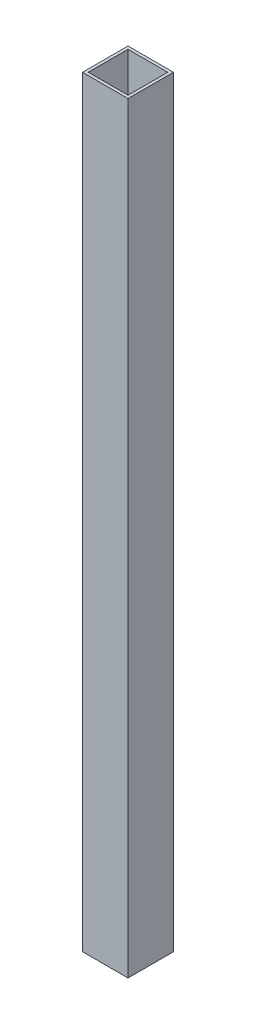
ISO-10303-21;
HEADER;
FILE_DESCRIPTION(('STEP AP214'),'2;1');
FILE_NAME('part.step','',(''),(''),'','','');
FILE_SCHEMA(('AUTOMOTIVE_DESIGN { 1 0 10303 214 1 1 1 1 }'));
ENDSEC;
DATA;
#1=APPLICATION_CONTEXT('core data for automotive mechanical design processes');
#2=APPLICATION_PROTOCOL_DEFINITION('international standard','automotive_design',2000,#1);
#3=PRODUCT_CONTEXT('',#1,'mechanical');
#4=PRODUCT('Part','Part','',(#3));
#5=PRODUCT_RELATED_PRODUCT_CATEGORY('part','',(#4));
#6=PRODUCT_DEFINITION_FORMATION('','',#4);
#7=PRODUCT_DEFINITION_CONTEXT('part definition',#1,'design');
#8=PRODUCT_DEFINITION('design','',#6,#7);
#9=PRODUCT_DEFINITION_SHAPE('','',#8);
#10=(LENGTH_UNIT() NAMED_UNIT(*) SI_UNIT(.MILLI.,.METRE.));
#11=(NAMED_UNIT(*) PLANE_ANGLE_UNIT() SI_UNIT($,.RADIAN.));
#12=(NAMED_UNIT(*) SI_UNIT($,.STERADIAN.) SOLID_ANGLE_UNIT());
#13=UNCERTAINTY_MEASURE_WITH_UNIT(LENGTH_MEASURE(1.E-05),#10,'distance_accuracy_value','');
#14=(GEOMETRIC_REPRESENTATION_CONTEXT(3) GLOBAL_UNCERTAINTY_ASSIGNED_CONTEXT((#13)) GLOBAL_UNIT_ASSIGNED_CONTEXT((#10,
#11,#12)) REPRESENTATION_CONTEXT('',''));
#15=CARTESIAN_POINT('',(0.,0.,0.));
#16=DIRECTION('',(0.,0.,1.));
#17=DIRECTION('',(1.,0.,0.));
#18=AXIS2_PLACEMENT_3D('',#15,#16,#17);
#19=CARTESIAN_POINT('',(25.4000000000001,922.742248335404,-25.4));
#20=DIRECTION('',(0.,0.,1.));
#21=DIRECTION('',(1.,0.,0.));
#22=AXIS2_PLACEMENT_3D('',#19,#20,#21);
#23=PLANE('',#22);
#24=DIRECTION('',(-1.,0.,0.));
#25=VECTOR('',#24,1.);
#26=CARTESIAN_POINT('',(25.4000000000001,850.900199366851,-25.4));
#27=LINE('',#26,#25);
#28=CARTESIAN_POINT('',(25.4000000000001,850.900199366851,-25.4));
#29=VERTEX_POINT('',#28);
#30=CARTESIAN_POINT('',(-25.3999999999999,850.900199366851,-25.4));
#31=VERTEX_POINT('',#30);
#32=EDGE_CURVE('E11',#29,#31,#27,.T.);
#33=ORIENTED_EDGE('',*,*,#32,.F.);
#34=DIRECTION('',(0.,-1.,0.));
#35=VECTOR('',#34,1.);
#36=CARTESIAN_POINT('',(25.4000000000001,922.742248335404,-25.4));
#37=LINE('',#36,#35);
#38=CARTESIAN_POINT('',(25.4000000000001,0.,-25.4));
#39=VERTEX_POINT('',#38);
#40=EDGE_CURVE('E141',#29,#39,#37,.T.);
#41=ORIENTED_EDGE('',*,*,#40,.T.);
#42=DIRECTION('',(-1.,0.,0.));
#43=VECTOR('',#42,1.);
#44=CARTESIAN_POINT('',(25.4000000000001,0.,-25.4));
#45=LINE('',#44,#43);
#46=CARTESIAN_POINT('',(-25.4000000000001,0.,-25.4));
#47=VERTEX_POINT('',#46);
#48=EDGE_CURVE('E136',#39,#47,#45,.T.);
#49=ORIENTED_EDGE('',*,*,#48,.T.);
#50=DIRECTION('',(0.,-1.,0.));
#51=VECTOR('',#50,1.);
#52=CARTESIAN_POINT('',(-25.3999999999999,922.742248335404,-25.4));
#53=LINE('',#52,#51);
#54=EDGE_CURVE('E139',#31,#47,#53,.T.);
#55=ORIENTED_EDGE('',*,*,#54,.F.);
#56=EDGE_LOOP('',(#33,#41,#49,#55));
#57=FACE_BOUND('',#56,.T.);
#58=ADVANCED_FACE('F29',(#57),#23,.F.);
#59=CARTESIAN_POINT('',(25.4000000000001,922.742248335404,25.4));
#60=DIRECTION('',(-1.,0.,0.));
#61=DIRECTION('',(0.,0.,1.));
#62=AXIS2_PLACEMENT_3D('',#59,#60,#61);
#63=PLANE('',#62);
#64=DIRECTION('',(0.,0.,-1.));
#65=VECTOR('',#64,1.);
#66=CARTESIAN_POINT('',(25.4000000000001,850.900199366851,25.4));
#67=LINE('',#66,#65);
#68=CARTESIAN_POINT('',(25.4000000000001,850.900199366851,25.4));
#69=VERTEX_POINT('',#68);
#70=EDGE_CURVE('E149',#69,#29,#67,.T.);
#71=ORIENTED_EDGE('',*,*,#70,.F.);
#72=DIRECTION('',(0.,-1.,0.));
#73=VECTOR('',#72,1.);
#74=CARTESIAN_POINT('',(25.4000000000001,922.742248335404,25.4));
#75=LINE('',#74,#73);
#76=CARTESIAN_POINT('',(25.4000000000001,0.,25.4));
#77=VERTEX_POINT('',#76);
#78=EDGE_CURVE('E143',#69,#77,#75,.T.);
#79=ORIENTED_EDGE('',*,*,#78,.T.);
#80=DIRECTION('',(0.,0.,-1.));
#81=VECTOR('',#80,1.);
#82=CARTESIAN_POINT('',(25.4000000000001,0.,25.4));
#83=LINE('',#82,#81);
#84=EDGE_CURVE('E133',#77,#39,#83,.T.);
#85=ORIENTED_EDGE('',*,*,#84,.T.);
#86=ORIENTED_EDGE('',*,*,#40,.F.);
#87=EDGE_LOOP('',(#71,#79,#85,#86));
#88=FACE_BOUND('',#87,.T.);
#89=ADVANCED_FACE('F173',(#88),#63,.F.);
#90=CARTESIAN_POINT('',(25.4000000000001,922.742248335404,25.4));
#91=DIRECTION('',(0.,0.,-1.));
#92=DIRECTION('',(-1.,0.,0.));
#93=AXIS2_PLACEMENT_3D('',#90,#91,#92);
#94=PLANE('',#93);
#95=DIRECTION('',(1.,0.,0.));
#96=VECTOR('',#95,1.);
#97=CARTESIAN_POINT('',(25.4000000000001,850.900199366851,25.4));
#98=LINE('',#97,#96);
#99=CARTESIAN_POINT('',(-25.3999999999999,850.900199366851,25.4));
#100=VERTEX_POINT('',#99);
#101=EDGE_CURVE('E33',#100,#69,#98,.T.);
#102=ORIENTED_EDGE('',*,*,#101,.F.);
#103=DIRECTION('',(0.,-1.,0.));
#104=VECTOR('',#103,1.);
#105=CARTESIAN_POINT('',(-25.3999999999999,922.742248335404,25.4));
#106=LINE('',#105,#104);
#107=CARTESIAN_POINT('',(-25.4000000000001,0.,25.4));
#108=VERTEX_POINT('',#107);
#109=EDGE_CURVE('E145',#100,#108,#106,.T.);
#110=ORIENTED_EDGE('',*,*,#109,.T.);
#111=DIRECTION('',(1.,0.,0.));
#112=VECTOR('',#111,1.);
#113=CARTESIAN_POINT('',(25.4000000000001,0.,25.4));
#114=LINE('',#113,#112);
#115=EDGE_CURVE('E130',#108,#77,#114,.T.);
#116=ORIENTED_EDGE('',*,*,#115,.T.);
#117=ORIENTED_EDGE('',*,*,#78,.F.);
#118=EDGE_LOOP('',(#102,#110,#116,#117));
#119=FACE_BOUND('',#118,.T.);
#120=ADVANCED_FACE('F179',(#119),#94,.F.);
#121=CARTESIAN_POINT('',(-25.3999999999999,922.742248335404,25.4));
#122=DIRECTION('',(1.,0.,0.));
#123=DIRECTION('',(0.,0.,-1.));
#124=AXIS2_PLACEMENT_3D('',#121,#122,#123);
#125=PLANE('',#124);
#126=DIRECTION('',(0.,0.,1.));
#127=VECTOR('',#126,1.);
#128=CARTESIAN_POINT('',(-25.3999999999999,850.900199366851,25.4));
#129=LINE('',#128,#127);
#130=EDGE_CURVE('E44',#31,#100,#129,.T.);
#131=ORIENTED_EDGE('',*,*,#130,.F.);
#132=ORIENTED_EDGE('',*,*,#54,.T.);
#133=DIRECTION('',(0.,0.,1.));
#134=VECTOR('',#133,1.);
#135=CARTESIAN_POINT('',(-25.4000000000001,0.,25.4));
#136=LINE('',#135,#134);
#137=EDGE_CURVE('E102',#47,#108,#136,.T.);
#138=ORIENTED_EDGE('',*,*,#137,.T.);
#139=ORIENTED_EDGE('',*,*,#109,.F.);
#140=EDGE_LOOP('',(#131,#132,#138,#139));
#141=FACE_BOUND('',#140,.T.);
#142=ADVANCED_FACE('F31',(#141),#125,.F.);
#143=CARTESIAN_POINT('',(0.,0.,0.));
#144=DIRECTION('',(0.,1.,0.));
#145=DIRECTION('',(0.,0.,1.));
#146=AXIS2_PLACEMENT_3D('',#143,#144,#145);
#147=PLANE('',#146);
#148=ORIENTED_EDGE('',*,*,#137,.F.);
#149=ORIENTED_EDGE('',*,*,#48,.F.);
#150=ORIENTED_EDGE('',*,*,#84,.F.);
#151=ORIENTED_EDGE('',*,*,#115,.F.);
#152=EDGE_LOOP('',(#148,#149,#150,#151));
#153=FACE_BOUND('',#152,.T.);
#154=DIRECTION('',(1.,0.,0.));
#155=VECTOR('',#154,1.);
#156=CARTESIAN_POINT('',(22.2249999999999,0.,22.225));
#157=LINE('',#156,#155);
#158=CARTESIAN_POINT('',(-22.2249999999999,0.,22.225));
#159=VERTEX_POINT('',#158);
#160=CARTESIAN_POINT('',(22.2249999999999,0.,22.225));
#161=VERTEX_POINT('',#160);
#162=EDGE_CURVE('E97',#159,#161,#157,.T.);
#163=ORIENTED_EDGE('',*,*,#162,.T.);
#164=DIRECTION('',(0.,0.,-1.));
#165=VECTOR('',#164,1.);
#166=CARTESIAN_POINT('',(22.2249999999999,0.,22.225));
#167=LINE('',#166,#165);
#168=CARTESIAN_POINT('',(22.2249999999999,0.,-22.225));
#169=VERTEX_POINT('',#168);
#170=EDGE_CURVE('E106',#161,#169,#167,.T.);
#171=ORIENTED_EDGE('',*,*,#170,.T.);
#172=DIRECTION('',(-1.,0.,0.));
#173=VECTOR('',#172,1.);
#174=CARTESIAN_POINT('',(22.2249999999999,0.,-22.225));
#175=LINE('',#174,#173);
#176=CARTESIAN_POINT('',(-22.2249999999999,0.,-22.225));
#177=VERTEX_POINT('',#176);
#178=EDGE_CURVE('E112',#169,#177,#175,.T.);
#179=ORIENTED_EDGE('',*,*,#178,.T.);
#180=DIRECTION('',(0.,0.,1.));
#181=VECTOR('',#180,1.);
#182=CARTESIAN_POINT('',(-22.2249999999999,0.,22.225));
#183=LINE('',#182,#181);
#184=EDGE_CURVE('E116',#177,#159,#183,.T.);
#185=ORIENTED_EDGE('',*,*,#184,.T.);
#186=EDGE_LOOP('',(#163,#171,#179,#185));
#187=FACE_BOUND('',#186,.T.);
#188=ADVANCED_FACE('F114',(#153,#187),#147,.F.);
#189=CARTESIAN_POINT('',(-22.2249999999999,922.742248335404,22.225));
#190=DIRECTION('',(1.,0.,0.));
#191=DIRECTION('',(0.,0.,-1.));
#192=AXIS2_PLACEMENT_3D('',#189,#190,#191);
#193=PLANE('',#192);
#194=DIRECTION('',(0.,-1.,0.));
#195=VECTOR('',#194,1.);
#196=CARTESIAN_POINT('',(-22.2249999999999,922.742248335404,-22.225));
#197=LINE('',#196,#195);
#198=CARTESIAN_POINT('',(-22.2249999999999,850.900199366851,-22.225));
#199=VERTEX_POINT('',#198);
#200=EDGE_CURVE('E125',#199,#177,#197,.T.);
#201=ORIENTED_EDGE('',*,*,#200,.F.);
#202=DIRECTION('',(0.,0.,1.));
#203=VECTOR('',#202,1.);
#204=CARTESIAN_POINT('',(-22.2249999999999,850.900199366851,22.225));
#205=LINE('',#204,#203);
#206=CARTESIAN_POINT('',(-22.2249999999999,850.900199366851,22.225));
#207=VERTEX_POINT('',#206);
#208=EDGE_CURVE('E147',#199,#207,#205,.T.);
#209=ORIENTED_EDGE('',*,*,#208,.T.);
#210=DIRECTION('',(0.,-1.,0.));
#211=VECTOR('',#210,1.);
#212=CARTESIAN_POINT('',(-22.2249999999999,922.742248335404,22.225));
#213=LINE('',#212,#211);
#214=EDGE_CURVE('E123',#207,#159,#213,.T.);
#215=ORIENTED_EDGE('',*,*,#214,.T.);
#216=ORIENTED_EDGE('',*,*,#184,.F.);
#217=EDGE_LOOP('',(#201,#209,#215,#216));
#218=FACE_BOUND('',#217,.T.);
#219=ADVANCED_FACE('F161',(#218),#193,.T.);
#220=CARTESIAN_POINT('',(22.2250000000002,922.742248335404,-22.225));
#221=DIRECTION('',(0.,0.,1.));
#222=DIRECTION('',(1.,0.,0.));
#223=AXIS2_PLACEMENT_3D('',#220,#221,#222);
#224=PLANE('',#223);
#225=DIRECTION('',(0.,-1.,0.));
#226=VECTOR('',#225,1.);
#227=CARTESIAN_POINT('',(22.2250000000002,922.742248335404,-22.225));
#228=LINE('',#227,#226);
#229=CARTESIAN_POINT('',(22.2250000000002,850.900199366851,-22.225));
#230=VERTEX_POINT('',#229);
#231=EDGE_CURVE('E103',#230,#169,#228,.T.);
#232=ORIENTED_EDGE('',*,*,#231,.F.);
#233=DIRECTION('',(-1.,0.,0.));
#234=VECTOR('',#233,1.);
#235=CARTESIAN_POINT('',(22.2250000000002,850.900199366851,-22.225));
#236=LINE('',#235,#234);
#237=EDGE_CURVE('E38',#230,#199,#236,.T.);
#238=ORIENTED_EDGE('',*,*,#237,.T.);
#239=ORIENTED_EDGE('',*,*,#200,.T.);
#240=ORIENTED_EDGE('',*,*,#178,.F.);
#241=EDGE_LOOP('',(#232,#238,#239,#240));
#242=FACE_BOUND('',#241,.T.);
#243=ADVANCED_FACE('F159',(#242),#224,.T.);
#244=CARTESIAN_POINT('',(22.2250000000002,922.742248335404,22.225));
#245=DIRECTION('',(-1.,0.,0.));
#246=DIRECTION('',(0.,0.,1.));
#247=AXIS2_PLACEMENT_3D('',#244,#245,#246);
#248=PLANE('',#247);
#249=DIRECTION('',(0.,-1.,0.));
#250=VECTOR('',#249,1.);
#251=CARTESIAN_POINT('',(22.2250000000002,922.742248335404,22.225));
#252=LINE('',#251,#250);
#253=CARTESIAN_POINT('',(22.2250000000002,850.900199366851,22.225));
#254=VERTEX_POINT('',#253);
#255=EDGE_CURVE('E92',#254,#161,#252,.T.);
#256=ORIENTED_EDGE('',*,*,#255,.F.);
#257=DIRECTION('',(0.,0.,-1.));
#258=VECTOR('',#257,1.);
#259=CARTESIAN_POINT('',(22.2250000000002,850.900199366851,22.225));
#260=LINE('',#259,#258);
#261=EDGE_CURVE('E155',#254,#230,#260,.T.);
#262=ORIENTED_EDGE('',*,*,#261,.T.);
#263=ORIENTED_EDGE('',*,*,#231,.T.);
#264=ORIENTED_EDGE('',*,*,#170,.F.);
#265=EDGE_LOOP('',(#256,#262,#263,#264));
#266=FACE_BOUND('',#265,.T.);
#267=ADVANCED_FACE('F107',(#266),#248,.T.);
#268=CARTESIAN_POINT('',(22.2250000000002,922.742248335404,22.225));
#269=DIRECTION('',(0.,0.,-1.));
#270=DIRECTION('',(-1.,0.,0.));
#271=AXIS2_PLACEMENT_3D('',#268,#269,#270);
#272=PLANE('',#271);
#273=ORIENTED_EDGE('',*,*,#214,.F.);
#274=DIRECTION('',(1.,0.,0.));
#275=VECTOR('',#274,1.);
#276=CARTESIAN_POINT('',(22.2250000000002,850.900199366851,22.225));
#277=LINE('',#276,#275);
#278=EDGE_CURVE('E99',#207,#254,#277,.T.);
#279=ORIENTED_EDGE('',*,*,#278,.T.);
#280=ORIENTED_EDGE('',*,*,#255,.T.);
#281=ORIENTED_EDGE('',*,*,#162,.F.);
#282=EDGE_LOOP('',(#273,#279,#280,#281));
#283=FACE_BOUND('',#282,.T.);
#284=ADVANCED_FACE('F95',(#283),#272,.T.);
#285=CARTESIAN_POINT('',(-546.099999999995,850.900199366852,25.4000000000001));
#286=DIRECTION('',(0.,1.,0.));
#287=DIRECTION('',(1.,0.,0.));
#288=AXIS2_PLACEMENT_3D('',#285,#286,#287);
#289=PLANE('',#288);
#290=ORIENTED_EDGE('',*,*,#208,.F.);
#291=ORIENTED_EDGE('',*,*,#237,.F.);
#292=ORIENTED_EDGE('',*,*,#261,.F.);
#293=ORIENTED_EDGE('',*,*,#278,.F.);
#294=EDGE_LOOP('',(#290,#291,#292,#293));
#295=FACE_BOUND('',#294,.T.);
#296=ORIENTED_EDGE('',*,*,#130,.T.);
#297=ORIENTED_EDGE('',*,*,#101,.T.);
#298=ORIENTED_EDGE('',*,*,#70,.T.);
#299=ORIENTED_EDGE('',*,*,#32,.T.);
#300=EDGE_LOOP('',(#296,#297,#298,#299));
#301=FACE_BOUND('',#300,.T.);
#302=ADVANCED_FACE('F197',(#295,#301),#289,.T.);
#303=CLOSED_SHELL('',(#58,#89,#120,#142,#188,#219,#243,#267,#284,#302));
#304=MANIFOLD_SOLID_BREP('B2',#303);
#305=ADVANCED_BREP_SHAPE_REPRESENTATION('',(#18,#304),#14);
#306=SHAPE_DEFINITION_REPRESENTATION(#9,#305);
ENDSEC;
END-ISO-10303-21;
